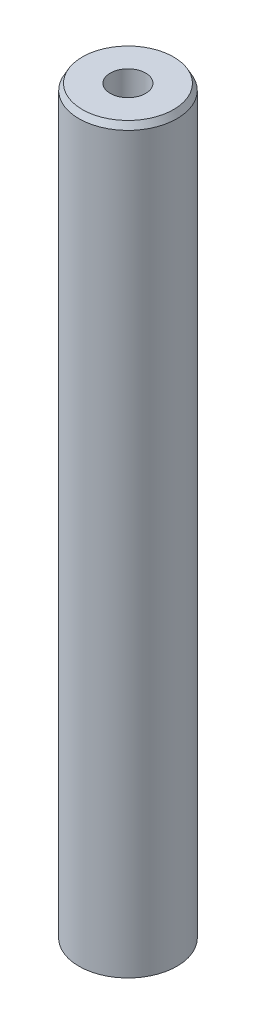
ISO-10303-21;
HEADER;
FILE_DESCRIPTION(('STEP AP214'),'2;1');
FILE_NAME('part.step','',(''),(''),'','','');
FILE_SCHEMA(('AUTOMOTIVE_DESIGN { 1 0 10303 214 1 1 1 1 }'));
ENDSEC;
DATA;
#1=APPLICATION_CONTEXT('core data for automotive mechanical design processes');
#2=APPLICATION_PROTOCOL_DEFINITION('international standard','automotive_design',2000,#1);
#3=PRODUCT_CONTEXT('',#1,'mechanical');
#4=PRODUCT('Part','Part','',(#3));
#5=PRODUCT_RELATED_PRODUCT_CATEGORY('part','',(#4));
#6=PRODUCT_DEFINITION_FORMATION('','',#4);
#7=PRODUCT_DEFINITION_CONTEXT('part definition',#1,'design');
#8=PRODUCT_DEFINITION('design','',#6,#7);
#9=PRODUCT_DEFINITION_SHAPE('','',#8);
#10=(LENGTH_UNIT() NAMED_UNIT(*) SI_UNIT(.MILLI.,.METRE.));
#11=(NAMED_UNIT(*) PLANE_ANGLE_UNIT() SI_UNIT($,.RADIAN.));
#12=(NAMED_UNIT(*) SI_UNIT($,.STERADIAN.) SOLID_ANGLE_UNIT());
#13=UNCERTAINTY_MEASURE_WITH_UNIT(LENGTH_MEASURE(1.E-05),#10,'distance_accuracy_value','');
#14=(GEOMETRIC_REPRESENTATION_CONTEXT(3) GLOBAL_UNCERTAINTY_ASSIGNED_CONTEXT((#13)) GLOBAL_UNIT_ASSIGNED_CONTEXT((#10,
#11,#12)) REPRESENTATION_CONTEXT('',''));
#15=CARTESIAN_POINT('',(0.,0.,0.));
#16=DIRECTION('',(0.,0.,1.));
#17=DIRECTION('',(1.,0.,0.));
#18=AXIS2_PLACEMENT_3D('',#15,#16,#17);
#19=CARTESIAN_POINT('',(0.,75.828726097365,0.));
#20=DIRECTION('',(0.,-1.,0.));
#21=DIRECTION('',(0.,0.,-1.));
#22=AXIS2_PLACEMENT_3D('',#19,#20,#21);
#23=CYLINDRICAL_SURFACE('',#22,5.);
#24=CARTESIAN_POINT('',(0.,75.198152888689,0.));
#25=DIRECTION('',(0.,1.,0.));
#26=DIRECTION('',(0.,0.,1.));
#27=AXIS2_PLACEMENT_3D('',#24,#25,#26);
#28=CIRCLE('',#27,5.);
#29=CARTESIAN_POINT('',(0.,75.198152888689,5.));
#30=VERTEX_POINT('',#29);
#31=EDGE_CURVE('E50',#30,#30,#28,.F.);
#32=ORIENTED_EDGE('',*,*,#31,.T.);
#33=EDGE_LOOP('',(#32));
#34=FACE_BOUND('',#33,.T.);
#35=CARTESIAN_POINT('',(0.,0.349005221157495,0.));
#36=DIRECTION('',(0.,1.,0.));
#37=DIRECTION('',(0.,0.,1.));
#38=AXIS2_PLACEMENT_3D('',#35,#36,#37);
#39=CIRCLE('',#38,5.);
#40=CARTESIAN_POINT('',(0.,0.349005221157495,5.));
#41=VERTEX_POINT('',#40);
#42=EDGE_CURVE('E51',#41,#41,#39,.T.);
#43=ORIENTED_EDGE('',*,*,#42,.T.);
#44=EDGE_LOOP('',(#43));
#45=FACE_BOUND('',#44,.T.);
#46=ADVANCED_FACE('F39',(#34,#45),#23,.T.);
#47=CARTESIAN_POINT('',(0.,75.828726097365,0.));
#48=DIRECTION('',(0.,1.,0.));
#49=DIRECTION('',(0.,0.,1.));
#50=AXIS2_PLACEMENT_3D('',#47,#48,#49);
#51=PLANE('',#50);
#52=CARTESIAN_POINT('',(0.,75.828726097365,0.));
#53=DIRECTION('',(0.,1.,0.));
#54=DIRECTION('',(0.,0.,1.));
#55=AXIS2_PLACEMENT_3D('',#52,#53,#54);
#56=CIRCLE('',#55,4.65099477884251);
#57=CARTESIAN_POINT('',(0.,75.828726097365,4.65099477884251));
#58=VERTEX_POINT('',#57);
#59=EDGE_CURVE('E54',#58,#58,#56,.T.);
#60=ORIENTED_EDGE('',*,*,#59,.T.);
#61=EDGE_LOOP('',(#60));
#62=FACE_BOUND('',#61,.T.);
#63=CARTESIAN_POINT('',(0.,75.828726097365,0.));
#64=DIRECTION('',(0.,1.,0.));
#65=DIRECTION('',(0.,0.,1.));
#66=AXIS2_PLACEMENT_3D('',#63,#64,#65);
#67=CIRCLE('',#66,1.80398885804179);
#68=CARTESIAN_POINT('',(0.,75.828726097365,1.80398885804179));
#69=VERTEX_POINT('',#68);
#70=EDGE_CURVE('E58',#69,#69,#67,.T.);
#71=ORIENTED_EDGE('',*,*,#70,.F.);
#72=EDGE_LOOP('',(#71));
#73=FACE_BOUND('',#72,.T.);
#74=ADVANCED_FACE('F69',(#62,#73),#51,.T.);
#75=CARTESIAN_POINT('',(0.,0.,0.));
#76=DIRECTION('',(0.,1.,0.));
#77=DIRECTION('',(0.,0.,1.));
#78=AXIS2_PLACEMENT_3D('',#75,#76,#77);
#79=PLANE('',#78);
#80=CARTESIAN_POINT('',(0.,0.,0.));
#81=DIRECTION('',(0.,1.,0.));
#82=DIRECTION('',(0.,0.,1.));
#83=AXIS2_PLACEMENT_3D('',#80,#81,#82);
#84=CIRCLE('',#83,4.36942679132396);
#85=CARTESIAN_POINT('',(0.,0.,4.36942679132396));
#86=VERTEX_POINT('',#85);
#87=EDGE_CURVE('E10',#86,#86,#84,.F.);
#88=ORIENTED_EDGE('',*,*,#87,.T.);
#89=EDGE_LOOP('',(#88));
#90=FACE_BOUND('',#89,.T.);
#91=CARTESIAN_POINT('',(0.,0.,0.));
#92=DIRECTION('',(0.,1.,0.));
#93=DIRECTION('',(0.,0.,1.));
#94=AXIS2_PLACEMENT_3D('',#91,#92,#93);
#95=CIRCLE('',#94,1.80398885804179);
#96=CARTESIAN_POINT('',(0.,0.,1.80398885804179));
#97=VERTEX_POINT('',#96);
#98=EDGE_CURVE('E63',#97,#97,#95,.T.);
#99=ORIENTED_EDGE('',*,*,#98,.T.);
#100=EDGE_LOOP('',(#99));
#101=FACE_BOUND('',#100,.T.);
#102=ADVANCED_FACE('F75',(#90,#101),#79,.F.);
#103=CARTESIAN_POINT('',(0.,75.828726097365,0.));
#104=DIRECTION('',(0.,-1.,0.));
#105=DIRECTION('',(0.,0.,-1.));
#106=AXIS2_PLACEMENT_3D('',#103,#104,#105);
#107=CYLINDRICAL_SURFACE('',#106,1.80398885804179);
#108=ORIENTED_EDGE('',*,*,#70,.T.);
#109=EDGE_LOOP('',(#108));
#110=FACE_BOUND('',#109,.T.);
#111=ORIENTED_EDGE('',*,*,#98,.F.);
#112=EDGE_LOOP('',(#111));
#113=FACE_BOUND('',#112,.T.);
#114=ADVANCED_FACE('F70',(#110,#113),#107,.F.);
#115=CARTESIAN_POINT('',(0.,75.828726097365,0.));
#116=DIRECTION('',(0.,-1.,0.));
#117=DIRECTION('',(0.,0.,-1.));
#118=AXIS2_PLACEMENT_3D('',#115,#116,#117);
#119=CONICAL_SURFACE('',#118,4.65099477884251,0.505505681168517);
#120=ORIENTED_EDGE('',*,*,#31,.F.);
#121=EDGE_LOOP('',(#120));
#122=FACE_BOUND('',#121,.T.);
#123=ORIENTED_EDGE('',*,*,#59,.F.);
#124=EDGE_LOOP('',(#123));
#125=FACE_BOUND('',#124,.T.);
#126=ADVANCED_FACE('F81',(#122,#125),#119,.T.);
#127=CARTESIAN_POINT('',(0.,0.349005221157495,0.));
#128=DIRECTION('',(0.,1.,0.));
#129=DIRECTION('',(0.,0.,1.));
#130=AXIS2_PLACEMENT_3D('',#127,#128,#129);
#131=CONICAL_SURFACE('',#130,5.,1.06529064562639);
#132=ORIENTED_EDGE('',*,*,#87,.F.);
#133=EDGE_LOOP('',(#132));
#134=FACE_BOUND('',#133,.T.);
#135=ORIENTED_EDGE('',*,*,#42,.F.);
#136=EDGE_LOOP('',(#135));
#137=FACE_BOUND('',#136,.T.);
#138=ADVANCED_FACE('F45',(#134,#137),#131,.T.);
#139=CLOSED_SHELL('',(#46,#74,#102,#114,#126,#138));
#140=MANIFOLD_SOLID_BREP('B2',#139);
#141=ADVANCED_BREP_SHAPE_REPRESENTATION('',(#18,#140),#14);
#142=SHAPE_DEFINITION_REPRESENTATION(#9,#141);
ENDSEC;
END-ISO-10303-21;
